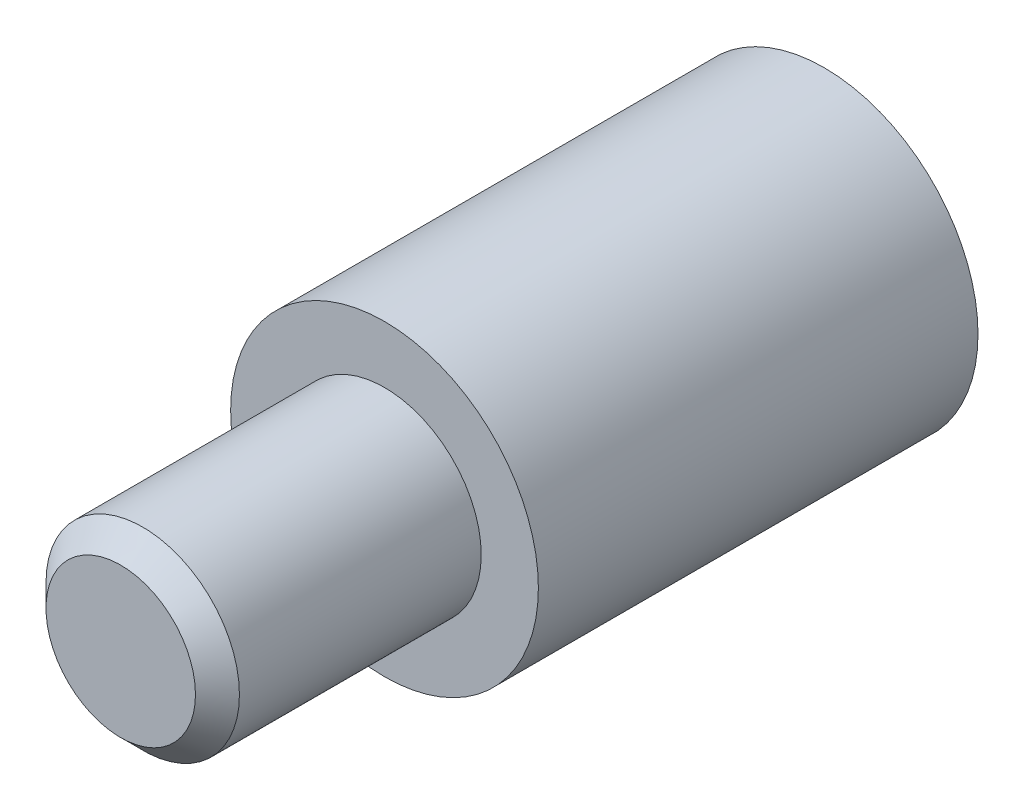
ISO-10303-21;
HEADER;
FILE_DESCRIPTION(('STEP AP214'),'2;1');
FILE_NAME('part.step','',(''),(''),'','','');
FILE_SCHEMA(('AUTOMOTIVE_DESIGN { 1 0 10303 214 1 1 1 1 }'));
ENDSEC;
DATA;
#1=APPLICATION_CONTEXT('core data for automotive mechanical design processes');
#2=APPLICATION_PROTOCOL_DEFINITION('international standard','automotive_design',2000,#1);
#3=PRODUCT_CONTEXT('',#1,'mechanical');
#4=PRODUCT('Part','Part','',(#3));
#5=PRODUCT_RELATED_PRODUCT_CATEGORY('part','',(#4));
#6=PRODUCT_DEFINITION_FORMATION('','',#4);
#7=PRODUCT_DEFINITION_CONTEXT('part definition',#1,'design');
#8=PRODUCT_DEFINITION('design','',#6,#7);
#9=PRODUCT_DEFINITION_SHAPE('','',#8);
#10=(LENGTH_UNIT() NAMED_UNIT(*) SI_UNIT(.MILLI.,.METRE.));
#11=(NAMED_UNIT(*) PLANE_ANGLE_UNIT() SI_UNIT($,.RADIAN.));
#12=(NAMED_UNIT(*) SI_UNIT($,.STERADIAN.) SOLID_ANGLE_UNIT());
#13=UNCERTAINTY_MEASURE_WITH_UNIT(LENGTH_MEASURE(1.E-05),#10,'distance_accuracy_value','');
#14=(GEOMETRIC_REPRESENTATION_CONTEXT(3) GLOBAL_UNCERTAINTY_ASSIGNED_CONTEXT((#13)) GLOBAL_UNIT_ASSIGNED_CONTEXT((#10,
#11,#12)) REPRESENTATION_CONTEXT('',''));
#15=CARTESIAN_POINT('',(0.,0.,0.));
#16=DIRECTION('',(0.,0.,1.));
#17=DIRECTION('',(1.,0.,0.));
#18=AXIS2_PLACEMENT_3D('',#15,#16,#17);
#19=CARTESIAN_POINT('',(59.7973510799828,58.0157984940244,100.935423220054));
#20=DIRECTION('',(0.,0.,1.));
#21=DIRECTION('',(1.,0.,0.));
#22=AXIS2_PLACEMENT_3D('',#19,#20,#21);
#23=CYLINDRICAL_SURFACE('',#22,3.5);
#24=CARTESIAN_POINT('',(59.7973510799828,58.0157984940244,107.935423220054));
#25=DIRECTION('',(0.,0.,-1.));
#26=DIRECTION('',(-1.,0.,0.));
#27=AXIS2_PLACEMENT_3D('',#24,#25,#26);
#28=CIRCLE('',#27,3.5);
#29=CARTESIAN_POINT('',(56.2973510799828,58.0157984940244,107.935423220054));
#30=VERTEX_POINT('',#29);
#31=EDGE_CURVE('E54',#30,#30,#28,.T.);
#32=ORIENTED_EDGE('',*,*,#31,.T.);
#33=EDGE_LOOP('',(#32));
#34=FACE_BOUND('',#33,.T.);
#35=CARTESIAN_POINT('',(59.7973510799828,58.0157984940244,97.9354232200538));
#36=DIRECTION('',(0.,0.,-1.));
#37=DIRECTION('',(-1.,0.,0.));
#38=AXIS2_PLACEMENT_3D('',#35,#36,#37);
#39=CIRCLE('',#38,3.50000000000001);
#40=CARTESIAN_POINT('',(56.2973510799828,58.0157984940244,97.9354232200538));
#41=VERTEX_POINT('',#40);
#42=EDGE_CURVE('E57',#41,#41,#39,.T.);
#43=ORIENTED_EDGE('',*,*,#42,.F.);
#44=EDGE_LOOP('',(#43));
#45=FACE_BOUND('',#44,.T.);
#46=ADVANCED_FACE('F33',(#34,#45),#23,.T.);
#47=CARTESIAN_POINT('',(59.7973510799828,58.0157984940244,107.935423220054));
#48=DIRECTION('',(0.,0.,-1.));
#49=DIRECTION('',(-1.,0.,0.));
#50=AXIS2_PLACEMENT_3D('',#47,#48,#49);
#51=PLANE('',#50);
#52=CARTESIAN_POINT('',(59.7973510799828,58.0157984940244,107.935423220054));
#53=DIRECTION('',(0.,0.,1.));
#54=DIRECTION('',(1.,0.,0.));
#55=AXIS2_PLACEMENT_3D('',#52,#53,#54);
#56=CIRCLE('',#55,2.2);
#57=CARTESIAN_POINT('',(61.9973510799828,58.0157984940244,107.935423220054));
#58=VERTEX_POINT('',#57);
#59=EDGE_CURVE('E45',#58,#58,#56,.T.);
#60=ORIENTED_EDGE('',*,*,#59,.F.);
#61=EDGE_LOOP('',(#60));
#62=FACE_BOUND('',#61,.T.);
#63=ORIENTED_EDGE('',*,*,#31,.F.);
#64=EDGE_LOOP('',(#63));
#65=FACE_BOUND('',#64,.T.);
#66=ADVANCED_FACE('F69',(#62,#65),#51,.F.);
#67=CARTESIAN_POINT('',(59.7973510799828,58.0157984940244,97.9354232200538));
#68=DIRECTION('',(0.,0.,-1.));
#69=DIRECTION('',(-1.,0.,0.));
#70=AXIS2_PLACEMENT_3D('',#67,#68,#69);
#71=PLANE('',#70);
#72=ORIENTED_EDGE('',*,*,#42,.T.);
#73=EDGE_LOOP('',(#72));
#74=FACE_BOUND('',#73,.T.);
#75=CARTESIAN_POINT('',(59.7973510799828,58.0157984940244,97.9354232200538));
#76=DIRECTION('',(0.,0.,-1.));
#77=DIRECTION('',(-1.,0.,0.));
#78=AXIS2_PLACEMENT_3D('',#75,#76,#77);
#79=CIRCLE('',#78,2.);
#80=CARTESIAN_POINT('',(57.7973510799828,58.0157984940244,97.9354232200538));
#81=VERTEX_POINT('',#80);
#82=EDGE_CURVE('E60',#81,#81,#79,.T.);
#83=ORIENTED_EDGE('',*,*,#82,.F.);
#84=EDGE_LOOP('',(#83));
#85=FACE_BOUND('',#84,.T.);
#86=ADVANCED_FACE('F67',(#74,#85),#71,.T.);
#87=CARTESIAN_POINT('',(59.7973510799828,58.0157984940244,97.9354232200538));
#88=DIRECTION('',(0.,0.,1.));
#89=DIRECTION('',(1.,0.,0.));
#90=AXIS2_PLACEMENT_3D('',#87,#88,#89);
#91=CYLINDRICAL_SURFACE('',#90,2.);
#92=ORIENTED_EDGE('',*,*,#82,.T.);
#93=EDGE_LOOP('',(#92));
#94=FACE_BOUND('',#93,.T.);
#95=CARTESIAN_POINT('',(59.7973510799828,58.0157984940244,100.935423220054));
#96=DIRECTION('',(0.,0.,-1.));
#97=DIRECTION('',(-1.,0.,0.));
#98=AXIS2_PLACEMENT_3D('',#95,#96,#97);
#99=CIRCLE('',#98,2.);
#100=CARTESIAN_POINT('',(57.7973510799828,58.0157984940244,100.935423220054));
#101=VERTEX_POINT('',#100);
#102=EDGE_CURVE('E49',#101,#101,#99,.F.);
#103=ORIENTED_EDGE('',*,*,#102,.T.);
#104=EDGE_LOOP('',(#103));
#105=FACE_BOUND('',#104,.T.);
#106=ADVANCED_FACE('F64',(#94,#105),#91,.F.);
#107=CARTESIAN_POINT('',(59.7973510799828,58.0157984940244,100.935423220054));
#108=DIRECTION('',(0.,0.,-1.));
#109=DIRECTION('',(-1.,0.,0.));
#110=AXIS2_PLACEMENT_3D('',#107,#108,#109);
#111=PLANE('',#110);
#112=ORIENTED_EDGE('',*,*,#102,.F.);
#113=EDGE_LOOP('',(#112));
#114=FACE_BOUND('',#113,.T.);
#115=ADVANCED_FACE('F76',(#114),#111,.T.);
#116=CARTESIAN_POINT('',(59.7973510799828,58.0157984940244,113.935423220054));
#117=DIRECTION('',(0.,0.,-1.));
#118=DIRECTION('',(-1.,0.,0.));
#119=AXIS2_PLACEMENT_3D('',#116,#117,#118);
#120=CYLINDRICAL_SURFACE('',#119,2.2);
#121=CARTESIAN_POINT('',(59.7973510799828,58.0157984940244,113.435423220054));
#122=DIRECTION('',(0.,0.,1.));
#123=DIRECTION('',(1.,0.,0.));
#124=AXIS2_PLACEMENT_3D('',#121,#122,#123);
#125=CIRCLE('',#124,2.2);
#126=CARTESIAN_POINT('',(61.9973510799828,58.0157984940244,113.435423220054));
#127=VERTEX_POINT('',#126);
#128=EDGE_CURVE('E10',#127,#127,#125,.F.);
#129=ORIENTED_EDGE('',*,*,#128,.T.);
#130=EDGE_LOOP('',(#129));
#131=FACE_BOUND('',#130,.T.);
#132=ORIENTED_EDGE('',*,*,#59,.T.);
#133=EDGE_LOOP('',(#132));
#134=FACE_BOUND('',#133,.T.);
#135=ADVANCED_FACE('F87',(#131,#134),#120,.T.);
#136=CARTESIAN_POINT('',(59.7973510799828,58.0157984940244,113.935423220054));
#137=DIRECTION('',(0.,0.,1.));
#138=DIRECTION('',(1.,0.,0.));
#139=AXIS2_PLACEMENT_3D('',#136,#137,#138);
#140=PLANE('',#139);
#141=CARTESIAN_POINT('',(59.7973510799828,58.0157984940244,113.935423220054));
#142=DIRECTION('',(0.,0.,1.));
#143=DIRECTION('',(1.,0.,0.));
#144=AXIS2_PLACEMENT_3D('',#141,#142,#143);
#145=CIRCLE('',#144,1.70000000000001);
#146=CARTESIAN_POINT('',(61.4973510799828,58.0157984940244,113.935423220054));
#147=VERTEX_POINT('',#146);
#148=EDGE_CURVE('E41',#147,#147,#145,.T.);
#149=ORIENTED_EDGE('',*,*,#148,.T.);
#150=EDGE_LOOP('',(#149));
#151=FACE_BOUND('',#150,.T.);
#152=ADVANCED_FACE('F92',(#151),#140,.T.);
#153=CARTESIAN_POINT('',(59.7973510799828,58.0157984940244,113.935423220054));
#154=DIRECTION('',(0.,0.,-1.));
#155=DIRECTION('',(-1.,0.,0.));
#156=AXIS2_PLACEMENT_3D('',#153,#154,#155);
#157=CONICAL_SURFACE('',#156,1.70000000000001,0.785398163397454);
#158=ORIENTED_EDGE('',*,*,#128,.F.);
#159=EDGE_LOOP('',(#158));
#160=FACE_BOUND('',#159,.T.);
#161=ORIENTED_EDGE('',*,*,#148,.F.);
#162=EDGE_LOOP('',(#161));
#163=FACE_BOUND('',#162,.T.);
#164=ADVANCED_FACE('F36',(#160,#163),#157,.T.);
#165=CLOSED_SHELL('',(#46,#66,#86,#106,#115,#135,#152,#164));
#166=MANIFOLD_SOLID_BREP('B2',#165);
#167=ADVANCED_BREP_SHAPE_REPRESENTATION('',(#18,#166),#14);
#168=SHAPE_DEFINITION_REPRESENTATION(#9,#167);
ENDSEC;
END-ISO-10303-21;
